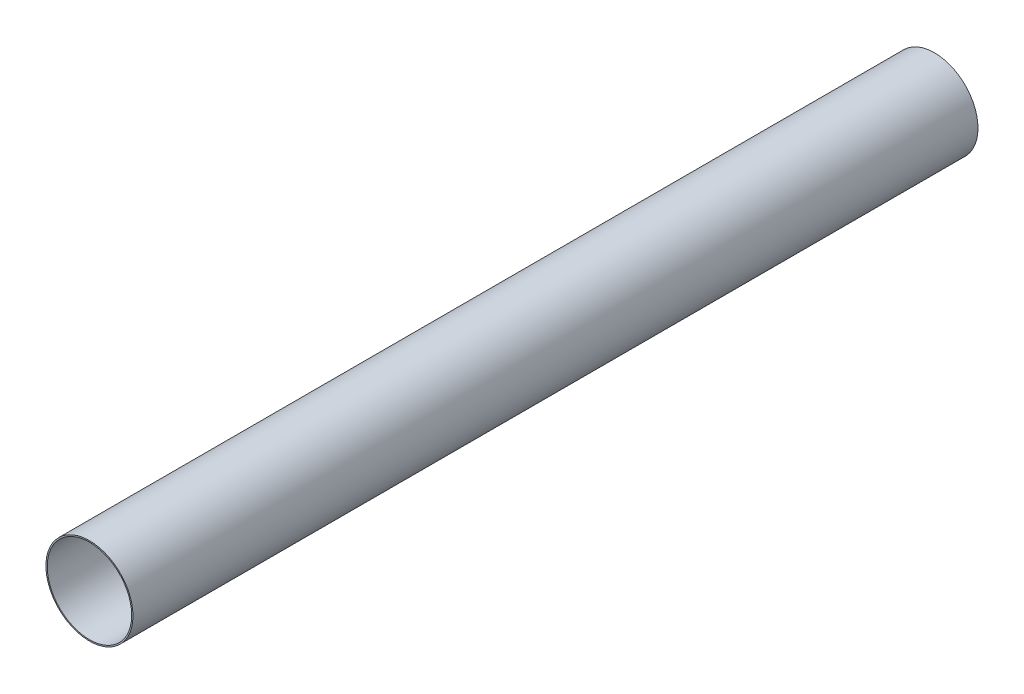
ISO-10303-21;
HEADER;
FILE_DESCRIPTION(('STEP AP214'),'2;1');
FILE_NAME('part.step','',(''),(''),'','','');
FILE_SCHEMA(('AUTOMOTIVE_DESIGN { 1 0 10303 214 1 1 1 1 }'));
ENDSEC;
DATA;
#1=APPLICATION_CONTEXT('core data for automotive mechanical design processes');
#2=APPLICATION_PROTOCOL_DEFINITION('international standard','automotive_design',2000,#1);
#3=PRODUCT_CONTEXT('',#1,'mechanical');
#4=PRODUCT('Part','Part','',(#3));
#5=PRODUCT_RELATED_PRODUCT_CATEGORY('part','',(#4));
#6=PRODUCT_DEFINITION_FORMATION('','',#4);
#7=PRODUCT_DEFINITION_CONTEXT('part definition',#1,'design');
#8=PRODUCT_DEFINITION('design','',#6,#7);
#9=PRODUCT_DEFINITION_SHAPE('','',#8);
#10=(LENGTH_UNIT() NAMED_UNIT(*) SI_UNIT(.MILLI.,.METRE.));
#11=(NAMED_UNIT(*) PLANE_ANGLE_UNIT() SI_UNIT($,.RADIAN.));
#12=(NAMED_UNIT(*) SI_UNIT($,.STERADIAN.) SOLID_ANGLE_UNIT());
#13=UNCERTAINTY_MEASURE_WITH_UNIT(LENGTH_MEASURE(1.E-05),#10,'distance_accuracy_value','');
#14=(GEOMETRIC_REPRESENTATION_CONTEXT(3) GLOBAL_UNCERTAINTY_ASSIGNED_CONTEXT((#13)) GLOBAL_UNIT_ASSIGNED_CONTEXT((#10,
#11,#12)) REPRESENTATION_CONTEXT('',''));
#15=CARTESIAN_POINT('',(0.,0.,0.));
#16=DIRECTION('',(0.,0.,1.));
#17=DIRECTION('',(1.,0.,0.));
#18=AXIS2_PLACEMENT_3D('',#15,#16,#17);
#19=CARTESIAN_POINT('',(0.,0.,381.));
#20=DIRECTION('',(0.,0.,1.));
#21=DIRECTION('',(1.,0.,0.));
#22=AXIS2_PLACEMENT_3D('',#19,#20,#21);
#23=PLANE('',#22);
#24=CARTESIAN_POINT('',(0.,0.,381.));
#25=DIRECTION('',(0.,0.,1.));
#26=DIRECTION('',(1.,0.,0.));
#27=AXIS2_PLACEMENT_3D('',#24,#25,#26);
#28=CIRCLE('',#27,39.2557);
#29=CARTESIAN_POINT('',(39.2557,0.,381.));
#30=VERTEX_POINT('',#29);
#31=EDGE_CURVE('E10',#30,#30,#28,.T.);
#32=ORIENTED_EDGE('',*,*,#31,.T.);
#33=EDGE_LOOP('',(#32));
#34=FACE_BOUND('',#33,.T.);
#35=CARTESIAN_POINT('',(0.,0.,381.));
#36=DIRECTION('',(0.,0.,1.));
#37=DIRECTION('',(1.,0.,0.));
#38=AXIS2_PLACEMENT_3D('',#35,#36,#37);
#39=CIRCLE('',#38,38.1);
#40=CARTESIAN_POINT('',(38.1,0.,381.));
#41=VERTEX_POINT('',#40);
#42=EDGE_CURVE('E54',#41,#41,#39,.T.);
#43=ORIENTED_EDGE('',*,*,#42,.F.);
#44=EDGE_LOOP('',(#43));
#45=FACE_BOUND('',#44,.T.);
#46=ADVANCED_FACE('F43',(#34,#45),#23,.T.);
#47=CARTESIAN_POINT('',(0.,0.,-381.));
#48=DIRECTION('',(0.,0.,1.));
#49=DIRECTION('',(1.,0.,0.));
#50=AXIS2_PLACEMENT_3D('',#47,#48,#49);
#51=PLANE('',#50);
#52=CARTESIAN_POINT('',(0.,0.,-381.));
#53=DIRECTION('',(0.,0.,1.));
#54=DIRECTION('',(1.,0.,0.));
#55=AXIS2_PLACEMENT_3D('',#52,#53,#54);
#56=CIRCLE('',#55,39.2557);
#57=CARTESIAN_POINT('',(39.2557,0.,-381.));
#58=VERTEX_POINT('',#57);
#59=EDGE_CURVE('E47',#58,#58,#56,.T.);
#60=ORIENTED_EDGE('',*,*,#59,.F.);
#61=EDGE_LOOP('',(#60));
#62=FACE_BOUND('',#61,.T.);
#63=CARTESIAN_POINT('',(0.,0.,-381.));
#64=DIRECTION('',(0.,0.,1.));
#65=DIRECTION('',(1.,0.,0.));
#66=AXIS2_PLACEMENT_3D('',#63,#64,#65);
#67=CIRCLE('',#66,38.1);
#68=CARTESIAN_POINT('',(38.1,0.,-381.));
#69=VERTEX_POINT('',#68);
#70=EDGE_CURVE('E56',#69,#69,#67,.T.);
#71=ORIENTED_EDGE('',*,*,#70,.T.);
#72=EDGE_LOOP('',(#71));
#73=FACE_BOUND('',#72,.T.);
#74=ADVANCED_FACE('F66',(#62,#73),#51,.F.);
#75=CARTESIAN_POINT('',(0.,0.,381.));
#76=DIRECTION('',(0.,0.,-1.));
#77=DIRECTION('',(-1.,0.,0.));
#78=AXIS2_PLACEMENT_3D('',#75,#76,#77);
#79=CYLINDRICAL_SURFACE('',#78,39.2557);
#80=ORIENTED_EDGE('',*,*,#31,.F.);
#81=EDGE_LOOP('',(#80));
#82=FACE_BOUND('',#81,.T.);
#83=ORIENTED_EDGE('',*,*,#59,.T.);
#84=EDGE_LOOP('',(#83));
#85=FACE_BOUND('',#84,.T.);
#86=ADVANCED_FACE('F45',(#82,#85),#79,.T.);
#87=CARTESIAN_POINT('',(0.,0.,381.));
#88=DIRECTION('',(0.,0.,-1.));
#89=DIRECTION('',(-1.,0.,0.));
#90=AXIS2_PLACEMENT_3D('',#87,#88,#89);
#91=CYLINDRICAL_SURFACE('',#90,38.1);
#92=ORIENTED_EDGE('',*,*,#42,.T.);
#93=EDGE_LOOP('',(#92));
#94=FACE_BOUND('',#93,.T.);
#95=ORIENTED_EDGE('',*,*,#70,.F.);
#96=EDGE_LOOP('',(#95));
#97=FACE_BOUND('',#96,.T.);
#98=ADVANCED_FACE('F62',(#94,#97),#91,.F.);
#99=CLOSED_SHELL('',(#46,#74,#86,#98));
#100=MANIFOLD_SOLID_BREP('B2',#99);
#101=ADVANCED_BREP_SHAPE_REPRESENTATION('',(#18,#100),#14);
#102=SHAPE_DEFINITION_REPRESENTATION(#9,#101);
ENDSEC;
END-ISO-10303-21;
